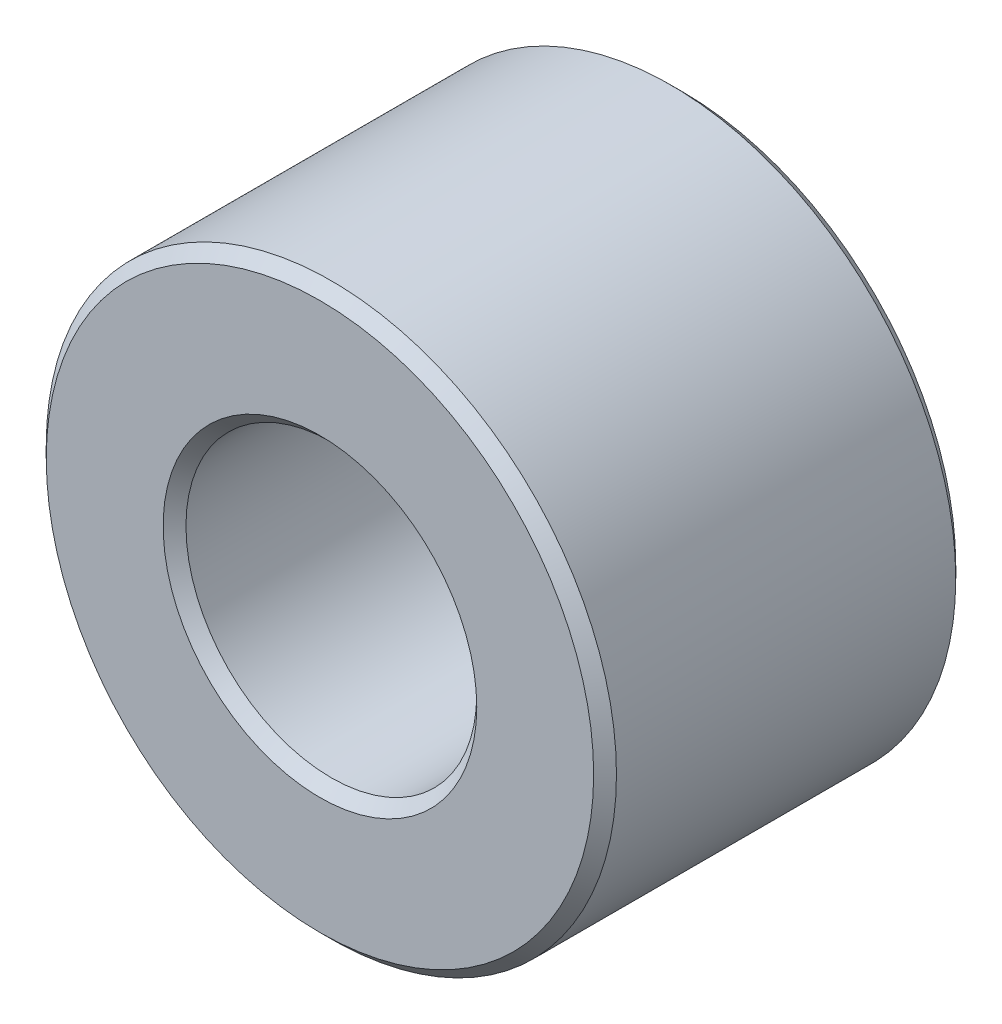
ISO-10303-21;
HEADER;
FILE_DESCRIPTION(('STEP AP214'),'2;1');
FILE_NAME('part.step','',(''),(''),'','','');
FILE_SCHEMA(('AUTOMOTIVE_DESIGN { 1 0 10303 214 1 1 1 1 }'));
ENDSEC;
DATA;
#1=APPLICATION_CONTEXT('core data for automotive mechanical design processes');
#2=APPLICATION_PROTOCOL_DEFINITION('international standard','automotive_design',2000,#1);
#3=PRODUCT_CONTEXT('',#1,'mechanical');
#4=PRODUCT('Part','Part','',(#3));
#5=PRODUCT_RELATED_PRODUCT_CATEGORY('part','',(#4));
#6=PRODUCT_DEFINITION_FORMATION('','',#4);
#7=PRODUCT_DEFINITION_CONTEXT('part definition',#1,'design');
#8=PRODUCT_DEFINITION('design','',#6,#7);
#9=PRODUCT_DEFINITION_SHAPE('','',#8);
#10=(LENGTH_UNIT() NAMED_UNIT(*) SI_UNIT(.MILLI.,.METRE.));
#11=(NAMED_UNIT(*) PLANE_ANGLE_UNIT() SI_UNIT($,.RADIAN.));
#12=(NAMED_UNIT(*) SI_UNIT($,.STERADIAN.) SOLID_ANGLE_UNIT());
#13=UNCERTAINTY_MEASURE_WITH_UNIT(LENGTH_MEASURE(1.E-05),#10,'distance_accuracy_value','');
#14=(GEOMETRIC_REPRESENTATION_CONTEXT(3) GLOBAL_UNCERTAINTY_ASSIGNED_CONTEXT((#13)) GLOBAL_UNIT_ASSIGNED_CONTEXT((#10,
#11,#12)) REPRESENTATION_CONTEXT('',''));
#15=CARTESIAN_POINT('',(0.,0.,0.));
#16=DIRECTION('',(0.,0.,1.));
#17=DIRECTION('',(1.,0.,0.));
#18=AXIS2_PLACEMENT_3D('',#15,#16,#17);
#19=CARTESIAN_POINT('',(0.,0.,6.35));
#20=DIRECTION('',(0.,0.,1.));
#21=DIRECTION('',(1.,0.,0.));
#22=AXIS2_PLACEMENT_3D('',#19,#20,#21);
#23=PLANE('',#22);
#24=CARTESIAN_POINT('',(0.,0.,6.35));
#25=DIRECTION('',(0.,0.,1.));
#26=DIRECTION('',(1.,0.,0.));
#27=AXIS2_PLACEMENT_3D('',#24,#25,#26);
#28=CIRCLE('',#27,2.75);
#29=CARTESIAN_POINT('',(2.75,0.,6.35));
#30=VERTEX_POINT('',#29);
#31=EDGE_CURVE('E10',#30,#30,#28,.F.);
#32=ORIENTED_EDGE('',*,*,#31,.T.);
#33=EDGE_LOOP('',(#32));
#34=FACE_BOUND('',#33,.T.);
#35=CARTESIAN_POINT('',(0.,0.,6.35));
#36=DIRECTION('',(0.,0.,1.));
#37=DIRECTION('',(1.,0.,0.));
#38=AXIS2_PLACEMENT_3D('',#35,#36,#37);
#39=CIRCLE('',#38,4.8);
#40=CARTESIAN_POINT('',(4.8,0.,6.35));
#41=VERTEX_POINT('',#40);
#42=EDGE_CURVE('E41',#41,#41,#39,.T.);
#43=ORIENTED_EDGE('',*,*,#42,.T.);
#44=EDGE_LOOP('',(#43));
#45=FACE_BOUND('',#44,.T.);
#46=ADVANCED_FACE('F34',(#34,#45),#23,.T.);
#47=CARTESIAN_POINT('',(0.,0.,0.));
#48=DIRECTION('',(0.,0.,1.));
#49=DIRECTION('',(1.,0.,0.));
#50=AXIS2_PLACEMENT_3D('',#47,#48,#49);
#51=PLANE('',#50);
#52=CARTESIAN_POINT('',(0.,0.,0.));
#53=DIRECTION('',(0.,0.,1.));
#54=DIRECTION('',(1.,0.,0.));
#55=AXIS2_PLACEMENT_3D('',#52,#53,#54);
#56=CIRCLE('',#55,4.8);
#57=CARTESIAN_POINT('',(4.8,0.,0.));
#58=VERTEX_POINT('',#57);
#59=EDGE_CURVE('E54',#58,#58,#56,.F.);
#60=ORIENTED_EDGE('',*,*,#59,.T.);
#61=EDGE_LOOP('',(#60));
#62=FACE_BOUND('',#61,.T.);
#63=CARTESIAN_POINT('',(0.,0.,0.));
#64=DIRECTION('',(0.,0.,1.));
#65=DIRECTION('',(1.,0.,0.));
#66=AXIS2_PLACEMENT_3D('',#63,#64,#65);
#67=CIRCLE('',#66,2.75);
#68=CARTESIAN_POINT('',(2.75,0.,0.));
#69=VERTEX_POINT('',#68);
#70=EDGE_CURVE('E57',#69,#69,#67,.T.);
#71=ORIENTED_EDGE('',*,*,#70,.T.);
#72=EDGE_LOOP('',(#71));
#73=FACE_BOUND('',#72,.T.);
#74=ADVANCED_FACE('F78',(#62,#73),#51,.F.);
#75=CARTESIAN_POINT('',(0.,0.,6.35));
#76=DIRECTION('',(0.,0.,-1.));
#77=DIRECTION('',(-1.,0.,0.));
#78=AXIS2_PLACEMENT_3D('',#75,#76,#77);
#79=CYLINDRICAL_SURFACE('',#78,5.);
#80=CARTESIAN_POINT('',(0.,0.,0.200000000000001));
#81=DIRECTION('',(0.,0.,1.));
#82=DIRECTION('',(1.,0.,0.));
#83=AXIS2_PLACEMENT_3D('',#80,#81,#82);
#84=CIRCLE('',#83,5.);
#85=CARTESIAN_POINT('',(5.,0.,0.200000000000001));
#86=VERTEX_POINT('',#85);
#87=EDGE_CURVE('E60',#86,#86,#84,.T.);
#88=ORIENTED_EDGE('',*,*,#87,.T.);
#89=EDGE_LOOP('',(#88));
#90=FACE_BOUND('',#89,.T.);
#91=CARTESIAN_POINT('',(0.,0.,6.15));
#92=DIRECTION('',(0.,0.,1.));
#93=DIRECTION('',(1.,0.,0.));
#94=AXIS2_PLACEMENT_3D('',#91,#92,#93);
#95=CIRCLE('',#94,5.);
#96=CARTESIAN_POINT('',(5.,0.,6.15));
#97=VERTEX_POINT('',#96);
#98=EDGE_CURVE('E63',#97,#97,#95,.F.);
#99=ORIENTED_EDGE('',*,*,#98,.T.);
#100=EDGE_LOOP('',(#99));
#101=FACE_BOUND('',#100,.T.);
#102=ADVANCED_FACE('F67',(#90,#101),#79,.T.);
#103=CARTESIAN_POINT('',(0.,0.,6.35));
#104=DIRECTION('',(0.,0.,-1.));
#105=DIRECTION('',(-1.,0.,0.));
#106=AXIS2_PLACEMENT_3D('',#103,#104,#105);
#107=CYLINDRICAL_SURFACE('',#106,2.55);
#108=CARTESIAN_POINT('',(0.,0.,0.200000000000001));
#109=DIRECTION('',(0.,0.,1.));
#110=DIRECTION('',(1.,0.,0.));
#111=AXIS2_PLACEMENT_3D('',#108,#109,#110);
#112=CIRCLE('',#111,2.55);
#113=CARTESIAN_POINT('',(2.55,0.,0.200000000000001));
#114=VERTEX_POINT('',#113);
#115=EDGE_CURVE('E45',#114,#114,#112,.F.);
#116=ORIENTED_EDGE('',*,*,#115,.T.);
#117=EDGE_LOOP('',(#116));
#118=FACE_BOUND('',#117,.T.);
#119=CARTESIAN_POINT('',(0.,0.,6.15));
#120=DIRECTION('',(0.,0.,1.));
#121=DIRECTION('',(1.,0.,0.));
#122=AXIS2_PLACEMENT_3D('',#119,#120,#121);
#123=CIRCLE('',#122,2.55);
#124=CARTESIAN_POINT('',(2.55,0.,6.15));
#125=VERTEX_POINT('',#124);
#126=EDGE_CURVE('E49',#125,#125,#123,.T.);
#127=ORIENTED_EDGE('',*,*,#126,.T.);
#128=EDGE_LOOP('',(#127));
#129=FACE_BOUND('',#128,.T.);
#130=ADVANCED_FACE('F86',(#118,#129),#107,.F.);
#131=CARTESIAN_POINT('',(0.,0.,0.200000000000001));
#132=DIRECTION('',(0.,0.,1.));
#133=DIRECTION('',(1.,0.,0.));
#134=AXIS2_PLACEMENT_3D('',#131,#132,#133);
#135=CONICAL_SURFACE('',#134,5.,0.785398163397448);
#136=ORIENTED_EDGE('',*,*,#59,.F.);
#137=EDGE_LOOP('',(#136));
#138=FACE_BOUND('',#137,.T.);
#139=ORIENTED_EDGE('',*,*,#87,.F.);
#140=EDGE_LOOP('',(#139));
#141=FACE_BOUND('',#140,.T.);
#142=ADVANCED_FACE('F91',(#138,#141),#135,.T.);
#143=CARTESIAN_POINT('',(0.,0.,0.));
#144=DIRECTION('',(0.,0.,-1.));
#145=DIRECTION('',(-1.,0.,0.));
#146=AXIS2_PLACEMENT_3D('',#143,#144,#145);
#147=CONICAL_SURFACE('',#146,2.75,0.785398163397447);
#148=ORIENTED_EDGE('',*,*,#115,.F.);
#149=EDGE_LOOP('',(#148));
#150=FACE_BOUND('',#149,.T.);
#151=ORIENTED_EDGE('',*,*,#70,.F.);
#152=EDGE_LOOP('',(#151));
#153=FACE_BOUND('',#152,.T.);
#154=ADVANCED_FACE('F75',(#150,#153),#147,.F.);
#155=CARTESIAN_POINT('',(0.,0.,6.15));
#156=DIRECTION('',(0.,0.,1.));
#157=DIRECTION('',(1.,0.,0.));
#158=AXIS2_PLACEMENT_3D('',#155,#156,#157);
#159=CONICAL_SURFACE('',#158,2.55,0.785398163397454);
#160=ORIENTED_EDGE('',*,*,#31,.F.);
#161=EDGE_LOOP('',(#160));
#162=FACE_BOUND('',#161,.T.);
#163=ORIENTED_EDGE('',*,*,#126,.F.);
#164=EDGE_LOOP('',(#163));
#165=FACE_BOUND('',#164,.T.);
#166=ADVANCED_FACE('F71',(#162,#165),#159,.F.);
#167=CARTESIAN_POINT('',(0.,0.,6.35));
#168=DIRECTION('',(0.,0.,-1.));
#169=DIRECTION('',(-1.,0.,0.));
#170=AXIS2_PLACEMENT_3D('',#167,#168,#169);
#171=CONICAL_SURFACE('',#170,4.8,0.785398163397444);
#172=ORIENTED_EDGE('',*,*,#98,.F.);
#173=EDGE_LOOP('',(#172));
#174=FACE_BOUND('',#173,.T.);
#175=ORIENTED_EDGE('',*,*,#42,.F.);
#176=EDGE_LOOP('',(#175));
#177=FACE_BOUND('',#176,.T.);
#178=ADVANCED_FACE('F36',(#174,#177),#171,.T.);
#179=CLOSED_SHELL('',(#46,#74,#102,#130,#142,#154,#166,#178));
#180=MANIFOLD_SOLID_BREP('B2',#179);
#181=ADVANCED_BREP_SHAPE_REPRESENTATION('',(#18,#180),#14);
#182=SHAPE_DEFINITION_REPRESENTATION(#9,#181);
ENDSEC;
END-ISO-10303-21;
